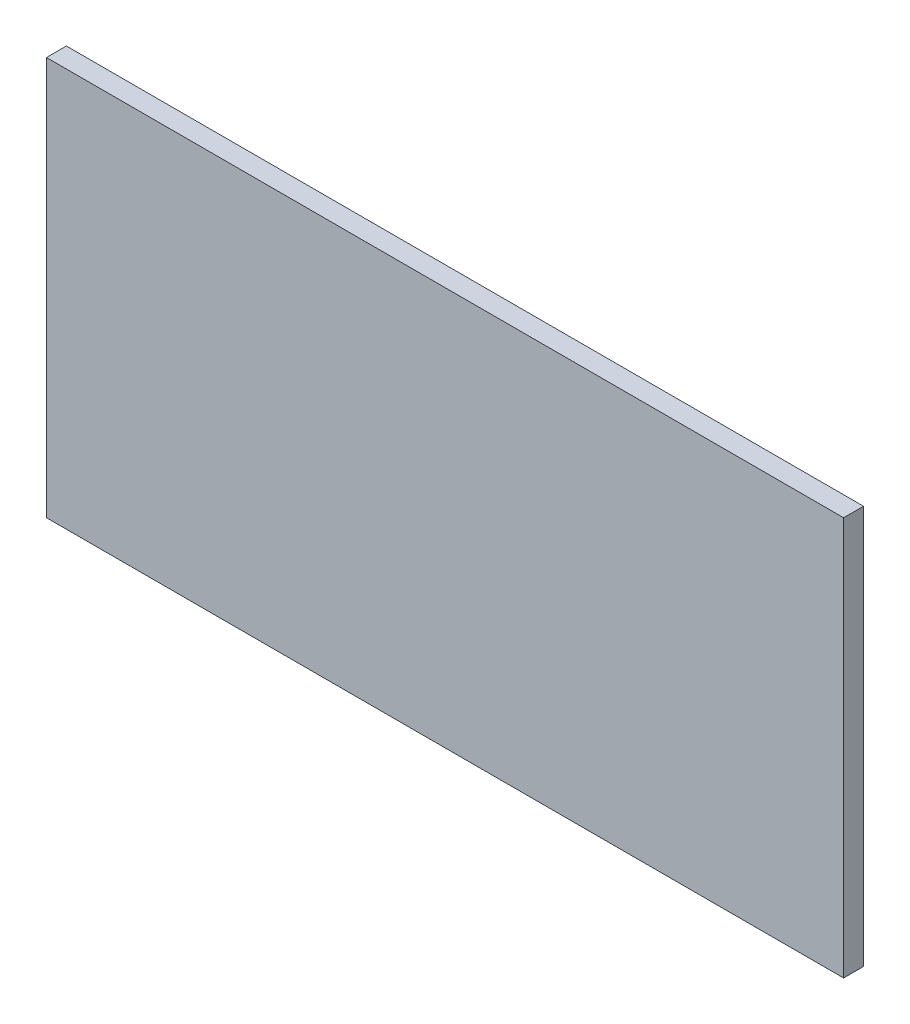
ISO-10303-21;
HEADER;
FILE_DESCRIPTION(('STEP AP214'),'2;1');
FILE_NAME('part.step','',(''),(''),'','','');
FILE_SCHEMA(('AUTOMOTIVE_DESIGN { 1 0 10303 214 1 1 1 1 }'));
ENDSEC;
DATA;
#1=APPLICATION_CONTEXT('core data for automotive mechanical design processes');
#2=APPLICATION_PROTOCOL_DEFINITION('international standard','automotive_design',2000,#1);
#3=PRODUCT_CONTEXT('',#1,'mechanical');
#4=PRODUCT('Part','Part','',(#3));
#5=PRODUCT_RELATED_PRODUCT_CATEGORY('part','',(#4));
#6=PRODUCT_DEFINITION_FORMATION('','',#4);
#7=PRODUCT_DEFINITION_CONTEXT('part definition',#1,'design');
#8=PRODUCT_DEFINITION('design','',#6,#7);
#9=PRODUCT_DEFINITION_SHAPE('','',#8);
#10=(LENGTH_UNIT() NAMED_UNIT(*) SI_UNIT(.MILLI.,.METRE.));
#11=(NAMED_UNIT(*) PLANE_ANGLE_UNIT() SI_UNIT($,.RADIAN.));
#12=(NAMED_UNIT(*) SI_UNIT($,.STERADIAN.) SOLID_ANGLE_UNIT());
#13=UNCERTAINTY_MEASURE_WITH_UNIT(LENGTH_MEASURE(1.E-05),#10,'distance_accuracy_value','');
#14=(GEOMETRIC_REPRESENTATION_CONTEXT(3) GLOBAL_UNCERTAINTY_ASSIGNED_CONTEXT((#13)) GLOBAL_UNIT_ASSIGNED_CONTEXT((#10,
#11,#12)) REPRESENTATION_CONTEXT('',''));
#15=CARTESIAN_POINT('',(0.,0.,0.));
#16=DIRECTION('',(0.,0.,1.));
#17=DIRECTION('',(1.,0.,0.));
#18=AXIS2_PLACEMENT_3D('',#15,#16,#17);
#19=CARTESIAN_POINT('',(0.,0.,10.));
#20=DIRECTION('',(1.,0.,0.));
#21=DIRECTION('',(0.,0.,-1.));
#22=AXIS2_PLACEMENT_3D('',#19,#20,#21);
#23=PLANE('',#22);
#24=DIRECTION('',(0.,-1.,0.));
#25=VECTOR('',#24,1.);
#26=CARTESIAN_POINT('',(0.,0.,0.));
#27=LINE('',#26,#25);
#28=CARTESIAN_POINT('',(0.,200.,0.));
#29=VERTEX_POINT('',#28);
#30=CARTESIAN_POINT('',(0.,0.,0.));
#31=VERTEX_POINT('',#30);
#32=EDGE_CURVE('E96',#29,#31,#27,.T.);
#33=ORIENTED_EDGE('',*,*,#32,.T.);
#34=DIRECTION('',(0.,0.,-1.));
#35=VECTOR('',#34,1.);
#36=CARTESIAN_POINT('',(0.,0.,10.));
#37=LINE('',#36,#35);
#38=CARTESIAN_POINT('',(0.,0.,10.));
#39=VERTEX_POINT('',#38);
#40=EDGE_CURVE('E11',#39,#31,#37,.T.);
#41=ORIENTED_EDGE('',*,*,#40,.F.);
#42=DIRECTION('',(0.,-1.,0.));
#43=VECTOR('',#42,1.);
#44=CARTESIAN_POINT('',(0.,0.,10.));
#45=LINE('',#44,#43);
#46=CARTESIAN_POINT('',(0.,200.,10.));
#47=VERTEX_POINT('',#46);
#48=EDGE_CURVE('E84',#47,#39,#45,.T.);
#49=ORIENTED_EDGE('',*,*,#48,.F.);
#50=DIRECTION('',(0.,0.,-1.));
#51=VECTOR('',#50,1.);
#52=CARTESIAN_POINT('',(0.,200.,10.));
#53=LINE('',#52,#51);
#54=EDGE_CURVE('E92',#47,#29,#53,.T.);
#55=ORIENTED_EDGE('',*,*,#54,.T.);
#56=EDGE_LOOP('',(#33,#41,#49,#55));
#57=FACE_BOUND('',#56,.T.);
#58=ADVANCED_FACE('F33',(#57),#23,.F.);
#59=CARTESIAN_POINT('',(0.,0.,10.));
#60=DIRECTION('',(0.,1.,0.));
#61=DIRECTION('',(0.,0.,1.));
#62=AXIS2_PLACEMENT_3D('',#59,#60,#61);
#63=PLANE('',#62);
#64=DIRECTION('',(1.,0.,0.));
#65=VECTOR('',#64,1.);
#66=CARTESIAN_POINT('',(0.,0.,0.));
#67=LINE('',#66,#65);
#68=CARTESIAN_POINT('',(399.999999999999,0.,0.));
#69=VERTEX_POINT('',#68);
#70=EDGE_CURVE('E88',#31,#69,#67,.T.);
#71=ORIENTED_EDGE('',*,*,#70,.T.);
#72=DIRECTION('',(0.,0.,-1.));
#73=VECTOR('',#72,1.);
#74=CARTESIAN_POINT('',(399.999999999999,0.,10.));
#75=LINE('',#74,#73);
#76=CARTESIAN_POINT('',(399.999999999999,0.,10.));
#77=VERTEX_POINT('',#76);
#78=EDGE_CURVE('E41',#77,#69,#75,.T.);
#79=ORIENTED_EDGE('',*,*,#78,.F.);
#80=DIRECTION('',(1.,0.,0.));
#81=VECTOR('',#80,1.);
#82=CARTESIAN_POINT('',(0.,0.,10.));
#83=LINE('',#82,#81);
#84=EDGE_CURVE('E79',#39,#77,#83,.T.);
#85=ORIENTED_EDGE('',*,*,#84,.F.);
#86=ORIENTED_EDGE('',*,*,#40,.T.);
#87=EDGE_LOOP('',(#71,#79,#85,#86));
#88=FACE_BOUND('',#87,.T.);
#89=ADVANCED_FACE('F87',(#88),#63,.F.);
#90=CARTESIAN_POINT('',(399.999999999999,0.,10.));
#91=DIRECTION('',(-1.,0.,0.));
#92=DIRECTION('',(0.,0.,1.));
#93=AXIS2_PLACEMENT_3D('',#90,#91,#92);
#94=PLANE('',#93);
#95=DIRECTION('',(0.,1.,0.));
#96=VECTOR('',#95,1.);
#97=CARTESIAN_POINT('',(399.999999999999,0.,0.));
#98=LINE('',#97,#96);
#99=CARTESIAN_POINT('',(399.999999999999,200.,0.));
#100=VERTEX_POINT('',#99);
#101=EDGE_CURVE('E66',#69,#100,#98,.T.);
#102=ORIENTED_EDGE('',*,*,#101,.T.);
#103=DIRECTION('',(0.,0.,-1.));
#104=VECTOR('',#103,1.);
#105=CARTESIAN_POINT('',(399.999999999999,200.,10.));
#106=LINE('',#105,#104);
#107=CARTESIAN_POINT('',(399.999999999999,200.,10.));
#108=VERTEX_POINT('',#107);
#109=EDGE_CURVE('E89',#108,#100,#106,.T.);
#110=ORIENTED_EDGE('',*,*,#109,.F.);
#111=DIRECTION('',(0.,1.,0.));
#112=VECTOR('',#111,1.);
#113=CARTESIAN_POINT('',(399.999999999999,0.,10.));
#114=LINE('',#113,#112);
#115=EDGE_CURVE('E82',#77,#108,#114,.T.);
#116=ORIENTED_EDGE('',*,*,#115,.F.);
#117=ORIENTED_EDGE('',*,*,#78,.T.);
#118=EDGE_LOOP('',(#102,#110,#116,#117));
#119=FACE_BOUND('',#118,.T.);
#120=ADVANCED_FACE('F90',(#119),#94,.F.);
#121=CARTESIAN_POINT('',(0.,200.,10.));
#122=DIRECTION('',(0.,-1.,0.));
#123=DIRECTION('',(0.,0.,-1.));
#124=AXIS2_PLACEMENT_3D('',#121,#122,#123);
#125=PLANE('',#124);
#126=DIRECTION('',(-1.,0.,0.));
#127=VECTOR('',#126,1.);
#128=CARTESIAN_POINT('',(0.,200.,0.));
#129=LINE('',#128,#127);
#130=EDGE_CURVE('E72',#100,#29,#129,.T.);
#131=ORIENTED_EDGE('',*,*,#130,.T.);
#132=ORIENTED_EDGE('',*,*,#54,.F.);
#133=DIRECTION('',(-1.,0.,0.));
#134=VECTOR('',#133,1.);
#135=CARTESIAN_POINT('',(0.,200.,10.));
#136=LINE('',#135,#134);
#137=EDGE_CURVE('E49',#108,#47,#136,.T.);
#138=ORIENTED_EDGE('',*,*,#137,.F.);
#139=ORIENTED_EDGE('',*,*,#109,.T.);
#140=EDGE_LOOP('',(#131,#132,#138,#139));
#141=FACE_BOUND('',#140,.T.);
#142=ADVANCED_FACE('F103',(#141),#125,.F.);
#143=CARTESIAN_POINT('',(0.,0.,10.));
#144=DIRECTION('',(0.,0.,-1.));
#145=DIRECTION('',(-1.,0.,0.));
#146=AXIS2_PLACEMENT_3D('',#143,#144,#145);
#147=PLANE('',#146);
#148=ORIENTED_EDGE('',*,*,#48,.T.);
#149=ORIENTED_EDGE('',*,*,#84,.T.);
#150=ORIENTED_EDGE('',*,*,#115,.T.);
#151=ORIENTED_EDGE('',*,*,#137,.T.);
#152=EDGE_LOOP('',(#148,#149,#150,#151));
#153=FACE_BOUND('',#152,.T.);
#154=ADVANCED_FACE('F80',(#153),#147,.F.);
#155=CARTESIAN_POINT('',(0.,0.,0.));
#156=DIRECTION('',(0.,0.,-1.));
#157=DIRECTION('',(-1.,0.,0.));
#158=AXIS2_PLACEMENT_3D('',#155,#156,#157);
#159=PLANE('',#158);
#160=ORIENTED_EDGE('',*,*,#32,.F.);
#161=ORIENTED_EDGE('',*,*,#130,.F.);
#162=ORIENTED_EDGE('',*,*,#101,.F.);
#163=ORIENTED_EDGE('',*,*,#70,.F.);
#164=EDGE_LOOP('',(#160,#161,#162,#163));
#165=FACE_BOUND('',#164,.T.);
#166=ADVANCED_FACE('F106',(#165),#159,.T.);
#167=CLOSED_SHELL('',(#58,#89,#120,#142,#154,#166));
#168=MANIFOLD_SOLID_BREP('B2',#167);
#169=ADVANCED_BREP_SHAPE_REPRESENTATION('',(#18,#168),#14);
#170=SHAPE_DEFINITION_REPRESENTATION(#9,#169);
ENDSEC;
END-ISO-10303-21;
